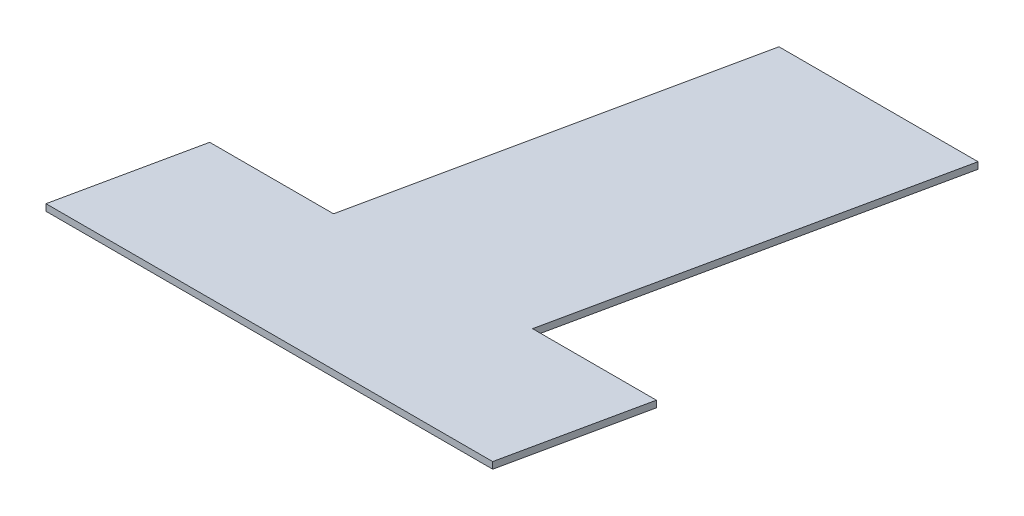
ISO-10303-21;
HEADER;
FILE_DESCRIPTION(('STEP AP214'),'2;1');
FILE_NAME('part.step','',(''),(''),'','','');
FILE_SCHEMA(('AUTOMOTIVE_DESIGN { 1 0 10303 214 1 1 1 1 }'));
ENDSEC;
DATA;
#1=APPLICATION_CONTEXT('core data for automotive mechanical design processes');
#2=APPLICATION_PROTOCOL_DEFINITION('international standard','automotive_design',2000,#1);
#3=PRODUCT_CONTEXT('',#1,'mechanical');
#4=PRODUCT('Part','Part','',(#3));
#5=PRODUCT_RELATED_PRODUCT_CATEGORY('part','',(#4));
#6=PRODUCT_DEFINITION_FORMATION('','',#4);
#7=PRODUCT_DEFINITION_CONTEXT('part definition',#1,'design');
#8=PRODUCT_DEFINITION('design','',#6,#7);
#9=PRODUCT_DEFINITION_SHAPE('','',#8);
#10=(LENGTH_UNIT() NAMED_UNIT(*) SI_UNIT(.MILLI.,.METRE.));
#11=(NAMED_UNIT(*) PLANE_ANGLE_UNIT() SI_UNIT($,.RADIAN.));
#12=(NAMED_UNIT(*) SI_UNIT($,.STERADIAN.) SOLID_ANGLE_UNIT());
#13=UNCERTAINTY_MEASURE_WITH_UNIT(LENGTH_MEASURE(1.E-05),#10,'distance_accuracy_value','');
#14=(GEOMETRIC_REPRESENTATION_CONTEXT(3) GLOBAL_UNCERTAINTY_ASSIGNED_CONTEXT((#13)) GLOBAL_UNIT_ASSIGNED_CONTEXT((#10,
#11,#12)) REPRESENTATION_CONTEXT('',''));
#15=CARTESIAN_POINT('',(0.,0.,0.));
#16=DIRECTION('',(0.,0.,1.));
#17=DIRECTION('',(1.,0.,0.));
#18=AXIS2_PLACEMENT_3D('',#15,#16,#17);
#19=CARTESIAN_POINT('',(-9.444134876,12.954,-114.4430429));
#20=DIRECTION('',(0.,1.,0.));
#21=DIRECTION('',(0.,0.,1.));
#22=AXIS2_PLACEMENT_3D('',#19,#20,#21);
#23=PLANE('',#22);
#24=DIRECTION('',(-1.,0.,0.));
#25=VECTOR('',#24,1.);
#26=CARTESIAN_POINT('',(-0.880853952000001,12.954,-95.181376233));
#27=LINE('',#26,#25);
#28=CARTESIAN_POINT('',(7.68242697231561,12.954,-95.181376233));
#29=VERTEX_POINT('',#28);
#30=CARTESIAN_POINT('',(-9.444134876,12.954,-95.181376233));
#31=VERTEX_POINT('',#30);
#32=EDGE_CURVE('E98',#29,#31,#27,.T.);
#33=ORIENTED_EDGE('',*,*,#32,.F.);
#34=DIRECTION('',(-0.207900611248898,0.,0.978149955703283));
#35=VECTOR('',#34,1.);
#36=CARTESIAN_POINT('',(8.2325536,12.954,-97.7696626915));
#37=LINE('',#36,#35);
#38=CARTESIAN_POINT('',(8.782680228,12.954,-100.357949149939));
#39=VERTEX_POINT('',#38);
#40=EDGE_CURVE('E88',#39,#29,#37,.T.);
#41=ORIENTED_EDGE('',*,*,#40,.F.);
#42=DIRECTION('',(1.,0.,0.));
#43=VECTOR('',#42,1.);
#44=CARTESIAN_POINT('',(6.408540905,12.954,-100.35794915));
#45=LINE('',#44,#43);
#46=CARTESIAN_POINT('',(4.03440158145175,12.954,-100.357949149939));
#47=VERTEX_POINT('',#46);
#48=EDGE_CURVE('E132',#47,#39,#45,.T.);
#49=ORIENTED_EDGE('',*,*,#48,.F.);
#50=DIRECTION('',(-0.207920286255703,0.,0.978145773677598));
#51=VECTOR('',#50,1.);
#52=CARTESIAN_POINT('',(5.5314058135,12.954,-107.400496025));
#53=LINE('',#52,#51);
#54=CARTESIAN_POINT('',(7.02841004436039,12.954,-114.4430429));
#55=VERTEX_POINT('',#54);
#56=EDGE_CURVE('E76',#55,#47,#53,.T.);
#57=ORIENTED_EDGE('',*,*,#56,.F.);
#58=DIRECTION('',(1.,0.,0.));
#59=VECTOR('',#58,1.);
#60=CARTESIAN_POINT('',(3.2131183785,12.954,-114.4430429));
#61=LINE('',#60,#59);
#62=CARTESIAN_POINT('',(-0.602173287180425,12.954,-114.4430429));
#63=VERTEX_POINT('',#62);
#64=EDGE_CURVE('E75',#63,#55,#61,.T.);
#65=ORIENTED_EDGE('',*,*,#64,.F.);
#66=DIRECTION('',(0.207920286255703,0.,-0.978145773677598));
#67=VECTOR('',#66,1.);
#68=CARTESIAN_POINT('',(-2.0991775195,12.954,-107.400496025));
#69=LINE('',#68,#67);
#70=CARTESIAN_POINT('',(-3.59618175008906,12.954,-100.357949149939));
#71=VERTEX_POINT('',#70);
#72=EDGE_CURVE('E120',#71,#63,#69,.T.);
#73=ORIENTED_EDGE('',*,*,#72,.F.);
#74=DIRECTION('',(1.,0.,0.));
#75=VECTOR('',#74,1.);
#76=CARTESIAN_POINT('',(-5.969742298,12.954,-100.35794915));
#77=LINE('',#76,#75);
#78=CARTESIAN_POINT('',(-8.34330284549391,12.954,-100.357949149939));
#79=VERTEX_POINT('',#78);
#80=EDGE_CURVE('E122',#79,#71,#77,.T.);
#81=ORIENTED_EDGE('',*,*,#80,.F.);
#82=DIRECTION('',(0.208005244310378,0.,-0.978127710648962));
#83=VECTOR('',#82,1.);
#84=CARTESIAN_POINT('',(-8.8937188605,12.954,-97.7696626915));
#85=LINE('',#84,#83);
#86=EDGE_CURVE('E116',#31,#79,#85,.T.);
#87=ORIENTED_EDGE('',*,*,#86,.F.);
#88=EDGE_LOOP('',(#33,#41,#49,#57,#65,#73,#81,#87));
#89=FACE_BOUND('',#88,.T.);
#90=ADVANCED_FACE('F17',(#89),#23,.T.);
#91=CARTESIAN_POINT('',(8.782680228,12.7,-100.35794915));
#92=DIRECTION('',(0.,0.,-1.));
#93=DIRECTION('',(-1.,0.,0.));
#94=AXIS2_PLACEMENT_3D('',#91,#92,#93);
#95=PLANE('',#94);
#96=DIRECTION('',(0.,-1.,0.));
#97=VECTOR('',#96,1.);
#98=CARTESIAN_POINT('',(4.034401582,12.827,-100.35794915));
#99=LINE('',#98,#97);
#100=CARTESIAN_POINT('',(4.03440158197409,12.7,-100.357949149878));
#101=VERTEX_POINT('',#100);
#102=EDGE_CURVE('E61',#47,#101,#99,.T.);
#103=ORIENTED_EDGE('',*,*,#102,.F.);
#104=ORIENTED_EDGE('',*,*,#48,.T.);
#105=DIRECTION('',(0.,1.,0.));
#106=VECTOR('',#105,1.);
#107=CARTESIAN_POINT('',(8.782680228,12.827,-100.35794915));
#108=LINE('',#107,#106);
#109=CARTESIAN_POINT('',(8.7826802279741,12.7,-100.357949149878));
#110=VERTEX_POINT('',#109);
#111=EDGE_CURVE('E92',#110,#39,#108,.T.);
#112=ORIENTED_EDGE('',*,*,#111,.F.);
#113=DIRECTION('',(-1.,0.,0.));
#114=VECTOR('',#113,1.);
#115=CARTESIAN_POINT('',(-0.330727324,12.7,-100.357949149756));
#116=LINE('',#115,#114);
#117=EDGE_CURVE('E87',#110,#101,#116,.T.);
#118=ORIENTED_EDGE('',*,*,#117,.T.);
#119=EDGE_LOOP('',(#103,#104,#112,#118));
#120=FACE_BOUND('',#119,.T.);
#121=ADVANCED_FACE('F135',(#120),#95,.T.);
#122=CARTESIAN_POINT('',(4.034401582,12.7,-100.35794915));
#123=DIRECTION('',(0.978145773677598,0.,0.207920286255703));
#124=DIRECTION('',(0.207920286255703,0.,-0.978145773677598));
#125=AXIS2_PLACEMENT_3D('',#122,#123,#124);
#126=PLANE('',#125);
#127=DIRECTION('',(0.,-1.,0.));
#128=VECTOR('',#127,1.);
#129=CARTESIAN_POINT('',(7.028410045,12.827,-114.4430429));
#130=LINE('',#129,#128);
#131=CARTESIAN_POINT('',(7.028410045,12.7,-114.4430429));
#132=VERTEX_POINT('',#131);
#133=EDGE_CURVE('E68',#55,#132,#130,.T.);
#134=ORIENTED_EDGE('',*,*,#133,.F.);
#135=ORIENTED_EDGE('',*,*,#56,.T.);
#136=ORIENTED_EDGE('',*,*,#102,.T.);
#137=DIRECTION('',(0.207920286255703,0.,-0.978145773677598));
#138=VECTOR('',#137,1.);
#139=CARTESIAN_POINT('',(4.034401582,12.7,-100.35794915));
#140=LINE('',#139,#138);
#141=EDGE_CURVE('E21',#101,#132,#140,.T.);
#142=ORIENTED_EDGE('',*,*,#141,.T.);
#143=EDGE_LOOP('',(#134,#135,#136,#142));
#144=FACE_BOUND('',#143,.T.);
#145=ADVANCED_FACE('F86',(#144),#126,.T.);
#146=CARTESIAN_POINT('',(7.028410045,12.7,-114.4430429));
#147=DIRECTION('',(0.,0.,-1.));
#148=DIRECTION('',(-1.,0.,0.));
#149=AXIS2_PLACEMENT_3D('',#146,#147,#148);
#150=PLANE('',#149);
#151=DIRECTION('',(0.,-1.,0.));
#152=VECTOR('',#151,1.);
#153=CARTESIAN_POINT('',(-0.602173288,12.827,-114.4430429));
#154=LINE('',#153,#152);
#155=CARTESIAN_POINT('',(-0.602173288,12.7,-114.4430429));
#156=VERTEX_POINT('',#155);
#157=EDGE_CURVE('E119',#63,#156,#154,.T.);
#158=ORIENTED_EDGE('',*,*,#157,.F.);
#159=ORIENTED_EDGE('',*,*,#64,.T.);
#160=ORIENTED_EDGE('',*,*,#133,.T.);
#161=DIRECTION('',(-1.,0.,0.));
#162=VECTOR('',#161,1.);
#163=CARTESIAN_POINT('',(-0.330727324,12.7,-114.4430429));
#164=LINE('',#163,#162);
#165=EDGE_CURVE('E72',#132,#156,#164,.T.);
#166=ORIENTED_EDGE('',*,*,#165,.T.);
#167=EDGE_LOOP('',(#158,#159,#160,#166));
#168=FACE_BOUND('',#167,.T.);
#169=ADVANCED_FACE('F71',(#168),#150,.T.);
#170=CARTESIAN_POINT('',(-0.602173288,12.7,-114.4430429));
#171=DIRECTION('',(-0.978145773677598,0.,-0.207920286255703));
#172=DIRECTION('',(-0.207920286255703,0.,0.978145773677598));
#173=AXIS2_PLACEMENT_3D('',#170,#171,#172);
#174=PLANE('',#173);
#175=DIRECTION('',(0.,-1.,0.));
#176=VECTOR('',#175,1.);
#177=CARTESIAN_POINT('',(-3.596181751,12.827,-100.35794915));
#178=LINE('',#177,#176);
#179=CARTESIAN_POINT('',(-3.59618175102591,12.7,-100.357949149878));
#180=VERTEX_POINT('',#179);
#181=EDGE_CURVE('E121',#71,#180,#178,.T.);
#182=ORIENTED_EDGE('',*,*,#181,.F.);
#183=ORIENTED_EDGE('',*,*,#72,.T.);
#184=ORIENTED_EDGE('',*,*,#157,.T.);
#185=DIRECTION('',(-0.207920286255703,0.,0.978145773677598));
#186=VECTOR('',#185,1.);
#187=CARTESIAN_POINT('',(-0.602173288,12.7,-114.4430429));
#188=LINE('',#187,#186);
#189=EDGE_CURVE('E84',#156,#180,#188,.T.);
#190=ORIENTED_EDGE('',*,*,#189,.T.);
#191=EDGE_LOOP('',(#182,#183,#184,#190));
#192=FACE_BOUND('',#191,.T.);
#193=ADVANCED_FACE('F163',(#192),#174,.T.);
#194=CARTESIAN_POINT('',(-3.596181751,12.7,-100.35794915));
#195=DIRECTION('',(0.,0.,-1.));
#196=DIRECTION('',(-1.,0.,0.));
#197=AXIS2_PLACEMENT_3D('',#194,#195,#196);
#198=PLANE('',#197);
#199=DIRECTION('',(0.,-1.,0.));
#200=VECTOR('',#199,1.);
#201=CARTESIAN_POINT('',(-8.343302845,12.827,-100.35794915));
#202=LINE('',#201,#200);
#203=CARTESIAN_POINT('',(-8.34330284502592,12.7,-100.357949149878));
#204=VERTEX_POINT('',#203);
#205=EDGE_CURVE('E112',#79,#204,#202,.T.);
#206=ORIENTED_EDGE('',*,*,#205,.F.);
#207=ORIENTED_EDGE('',*,*,#80,.T.);
#208=ORIENTED_EDGE('',*,*,#181,.T.);
#209=DIRECTION('',(-1.,0.,0.));
#210=VECTOR('',#209,1.);
#211=CARTESIAN_POINT('',(-0.330727324,12.7,-100.357949149756));
#212=LINE('',#211,#210);
#213=EDGE_CURVE('E103',#180,#204,#212,.T.);
#214=ORIENTED_EDGE('',*,*,#213,.T.);
#215=EDGE_LOOP('',(#206,#207,#208,#214));
#216=FACE_BOUND('',#215,.T.);
#217=ADVANCED_FACE('F162',(#216),#198,.T.);
#218=CARTESIAN_POINT('',(-8.343302845,12.7,-100.35794915));
#219=DIRECTION('',(-0.978127710648962,0.,-0.208005244310378));
#220=DIRECTION('',(-0.208005244310378,0.,0.978127710648962));
#221=AXIS2_PLACEMENT_3D('',#218,#219,#220);
#222=PLANE('',#221);
#223=DIRECTION('',(0.,-1.,0.));
#224=VECTOR('',#223,1.);
#225=CARTESIAN_POINT('',(-9.444134876,12.827,-95.181376233));
#226=LINE('',#225,#224);
#227=CARTESIAN_POINT('',(-9.444134876,12.7,-95.181376233));
#228=VERTEX_POINT('',#227);
#229=EDGE_CURVE('E114',#31,#228,#226,.T.);
#230=ORIENTED_EDGE('',*,*,#229,.F.);
#231=ORIENTED_EDGE('',*,*,#86,.T.);
#232=ORIENTED_EDGE('',*,*,#205,.T.);
#233=DIRECTION('',(-0.208005244310378,0.,0.978127710648962));
#234=VECTOR('',#233,1.);
#235=CARTESIAN_POINT('',(-8.343302845,12.7,-100.35794915));
#236=LINE('',#235,#234);
#237=EDGE_CURVE('E101',#204,#228,#236,.T.);
#238=ORIENTED_EDGE('',*,*,#237,.T.);
#239=EDGE_LOOP('',(#230,#231,#232,#238));
#240=FACE_BOUND('',#239,.T.);
#241=ADVANCED_FACE('F155',(#240),#222,.T.);
#242=CARTESIAN_POINT('',(-9.444134876,12.7,-95.181376233));
#243=DIRECTION('',(0.,0.,1.));
#244=DIRECTION('',(1.,0.,0.));
#245=AXIS2_PLACEMENT_3D('',#242,#243,#244);
#246=PLANE('',#245);
#247=DIRECTION('',(0.,-1.,0.));
#248=VECTOR('',#247,1.);
#249=CARTESIAN_POINT('',(7.682426972,12.827,-95.181376233));
#250=LINE('',#249,#248);
#251=CARTESIAN_POINT('',(7.682426972,12.7,-95.181376233));
#252=VERTEX_POINT('',#251);
#253=EDGE_CURVE('E35',#29,#252,#250,.T.);
#254=ORIENTED_EDGE('',*,*,#253,.F.);
#255=ORIENTED_EDGE('',*,*,#32,.T.);
#256=ORIENTED_EDGE('',*,*,#229,.T.);
#257=DIRECTION('',(1.,0.,0.));
#258=VECTOR('',#257,1.);
#259=CARTESIAN_POINT('',(-0.330727324,12.7,-95.181376233));
#260=LINE('',#259,#258);
#261=EDGE_CURVE('E27',#228,#252,#260,.T.);
#262=ORIENTED_EDGE('',*,*,#261,.T.);
#263=EDGE_LOOP('',(#254,#255,#256,#262));
#264=FACE_BOUND('',#263,.T.);
#265=ADVANCED_FACE('F156',(#264),#246,.T.);
#266=CARTESIAN_POINT('',(7.682426972,12.7,-95.181376233));
#267=DIRECTION('',(0.978149955703283,0.,0.207900611248898));
#268=DIRECTION('',(0.207900611248898,0.,-0.978149955703283));
#269=AXIS2_PLACEMENT_3D('',#266,#267,#268);
#270=PLANE('',#269);
#271=ORIENTED_EDGE('',*,*,#111,.T.);
#272=ORIENTED_EDGE('',*,*,#40,.T.);
#273=ORIENTED_EDGE('',*,*,#253,.T.);
#274=DIRECTION('',(0.207900611248898,0.,-0.978149955703283));
#275=VECTOR('',#274,1.);
#276=CARTESIAN_POINT('',(7.682426972,12.7,-95.181376233));
#277=LINE('',#276,#275);
#278=EDGE_CURVE('E11',#252,#110,#277,.T.);
#279=ORIENTED_EDGE('',*,*,#278,.T.);
#280=EDGE_LOOP('',(#271,#272,#273,#279));
#281=FACE_BOUND('',#280,.T.);
#282=ADVANCED_FACE('F141',(#281),#270,.T.);
#283=CARTESIAN_POINT('',(-9.444134876,12.7,-114.4430429));
#284=DIRECTION('',(0.,1.,0.));
#285=DIRECTION('',(0.,0.,1.));
#286=AXIS2_PLACEMENT_3D('',#283,#284,#285);
#287=PLANE('',#286);
#288=ORIENTED_EDGE('',*,*,#261,.F.);
#289=ORIENTED_EDGE('',*,*,#237,.F.);
#290=ORIENTED_EDGE('',*,*,#213,.F.);
#291=ORIENTED_EDGE('',*,*,#189,.F.);
#292=ORIENTED_EDGE('',*,*,#165,.F.);
#293=ORIENTED_EDGE('',*,*,#141,.F.);
#294=ORIENTED_EDGE('',*,*,#117,.F.);
#295=ORIENTED_EDGE('',*,*,#278,.F.);
#296=EDGE_LOOP('',(#288,#289,#290,#291,#292,#293,#294,#295));
#297=FACE_BOUND('',#296,.T.);
#298=ADVANCED_FACE('F19',(#297),#287,.F.);
#299=CLOSED_SHELL('',(#90,#121,#145,#169,#193,#217,#241,#265,#282,#298));
#300=MANIFOLD_SOLID_BREP('B1',#299);
#301=ADVANCED_BREP_SHAPE_REPRESENTATION('',(#18,#300),#14);
#302=SHAPE_DEFINITION_REPRESENTATION(#9,#301);
ENDSEC;
END-ISO-10303-21;
